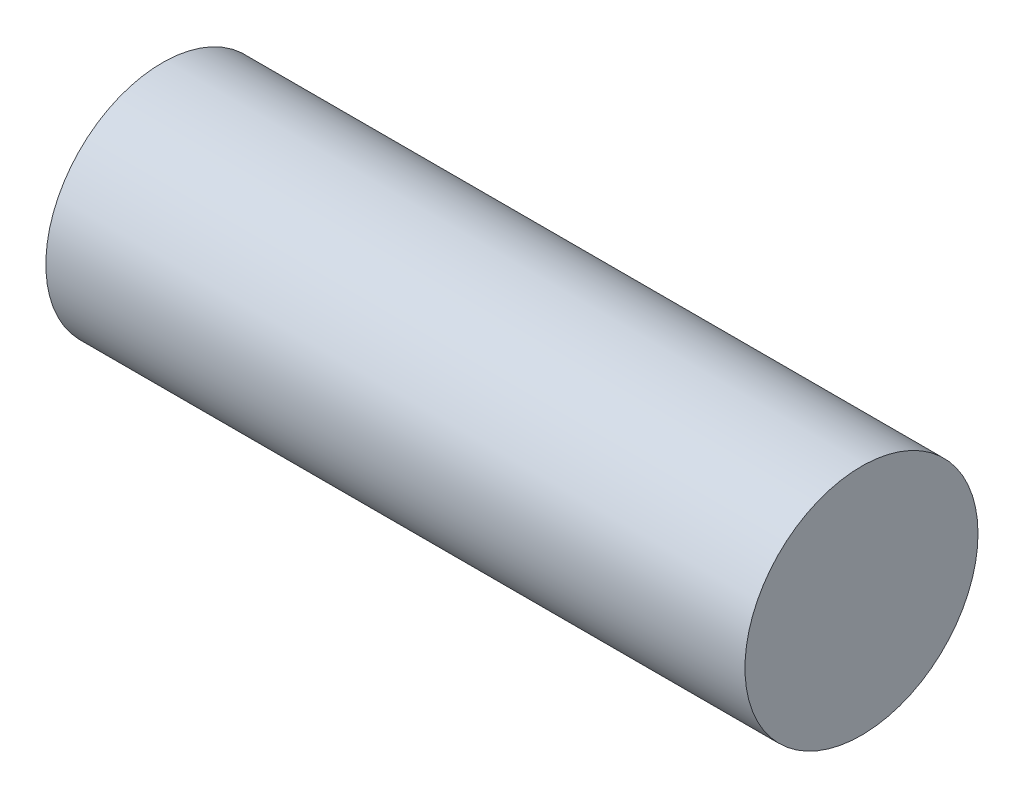
ISO-10303-21;
HEADER;
FILE_DESCRIPTION(('STEP AP214'),'2;1');
FILE_NAME('part.step','',(''),(''),'','','');
FILE_SCHEMA(('AUTOMOTIVE_DESIGN { 1 0 10303 214 1 1 1 1 }'));
ENDSEC;
DATA;
#1=APPLICATION_CONTEXT('core data for automotive mechanical design processes');
#2=APPLICATION_PROTOCOL_DEFINITION('international standard','automotive_design',2000,#1);
#3=PRODUCT_CONTEXT('',#1,'mechanical');
#4=PRODUCT('Part','Part','',(#3));
#5=PRODUCT_RELATED_PRODUCT_CATEGORY('part','',(#4));
#6=PRODUCT_DEFINITION_FORMATION('','',#4);
#7=PRODUCT_DEFINITION_CONTEXT('part definition',#1,'design');
#8=PRODUCT_DEFINITION('design','',#6,#7);
#9=PRODUCT_DEFINITION_SHAPE('','',#8);
#10=(LENGTH_UNIT() NAMED_UNIT(*) SI_UNIT(.MILLI.,.METRE.));
#11=(NAMED_UNIT(*) PLANE_ANGLE_UNIT() SI_UNIT($,.RADIAN.));
#12=(NAMED_UNIT(*) SI_UNIT($,.STERADIAN.) SOLID_ANGLE_UNIT());
#13=UNCERTAINTY_MEASURE_WITH_UNIT(LENGTH_MEASURE(1.E-05),#10,'distance_accuracy_value','');
#14=(GEOMETRIC_REPRESENTATION_CONTEXT(3) GLOBAL_UNCERTAINTY_ASSIGNED_CONTEXT((#13)) GLOBAL_UNIT_ASSIGNED_CONTEXT((#10,
#11,#12)) REPRESENTATION_CONTEXT('',''));
#15=CARTESIAN_POINT('',(0.,0.,0.));
#16=DIRECTION('',(0.,0.,1.));
#17=DIRECTION('',(1.,0.,0.));
#18=AXIS2_PLACEMENT_3D('',#15,#16,#17);
#19=CARTESIAN_POINT('',(3.81,0.,0.));
#20=DIRECTION('',(-1.,0.,0.));
#21=DIRECTION('',(0.,0.,1.));
#22=AXIS2_PLACEMENT_3D('',#19,#20,#21);
#23=CYLINDRICAL_SURFACE('',#22,0.635);
#24=CARTESIAN_POINT('',(3.81,0.,0.));
#25=DIRECTION('',(1.,0.,0.));
#26=DIRECTION('',(0.,0.,-1.));
#27=AXIS2_PLACEMENT_3D('',#24,#25,#26);
#28=CIRCLE('',#27,0.635);
#29=CARTESIAN_POINT('',(3.81,0.,-0.635));
#30=VERTEX_POINT('',#29);
#31=EDGE_CURVE('E10',#30,#30,#28,.T.);
#32=ORIENTED_EDGE('',*,*,#31,.F.);
#33=EDGE_LOOP('',(#32));
#34=FACE_BOUND('',#33,.T.);
#35=CARTESIAN_POINT('',(0.,0.,0.));
#36=DIRECTION('',(1.,0.,0.));
#37=DIRECTION('',(0.,0.,-1.));
#38=AXIS2_PLACEMENT_3D('',#35,#36,#37);
#39=CIRCLE('',#38,0.635);
#40=CARTESIAN_POINT('',(0.,0.,-0.635));
#41=VERTEX_POINT('',#40);
#42=EDGE_CURVE('E44',#41,#41,#39,.T.);
#43=ORIENTED_EDGE('',*,*,#42,.T.);
#44=EDGE_LOOP('',(#43));
#45=FACE_BOUND('',#44,.T.);
#46=ADVANCED_FACE('F41',(#34,#45),#23,.T.);
#47=CARTESIAN_POINT('',(3.81,0.,0.));
#48=DIRECTION('',(1.,0.,0.));
#49=DIRECTION('',(0.,0.,-1.));
#50=AXIS2_PLACEMENT_3D('',#47,#48,#49);
#51=PLANE('',#50);
#52=ORIENTED_EDGE('',*,*,#31,.T.);
#53=EDGE_LOOP('',(#52));
#54=FACE_BOUND('',#53,.T.);
#55=ADVANCED_FACE('F56',(#54),#51,.T.);
#56=CARTESIAN_POINT('',(0.,0.,0.));
#57=DIRECTION('',(1.,0.,0.));
#58=DIRECTION('',(0.,0.,-1.));
#59=AXIS2_PLACEMENT_3D('',#56,#57,#58);
#60=PLANE('',#59);
#61=ORIENTED_EDGE('',*,*,#42,.F.);
#62=EDGE_LOOP('',(#61));
#63=FACE_BOUND('',#62,.T.);
#64=ADVANCED_FACE('F54',(#63),#60,.F.);
#65=CLOSED_SHELL('',(#46,#55,#64));
#66=MANIFOLD_SOLID_BREP('B2',#65);
#67=ADVANCED_BREP_SHAPE_REPRESENTATION('',(#18,#66),#14);
#68=SHAPE_DEFINITION_REPRESENTATION(#9,#67);
ENDSEC;
END-ISO-10303-21;
